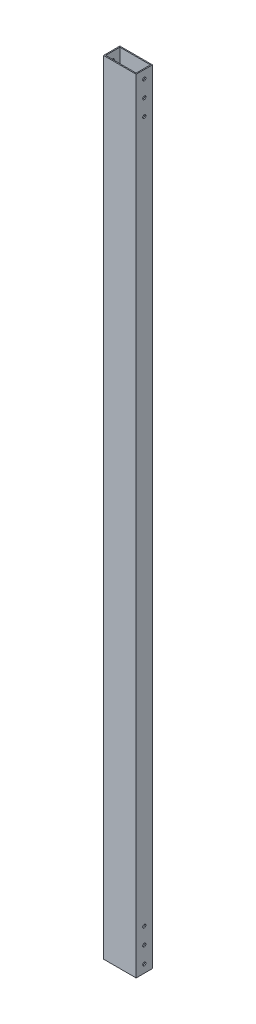
ISO-10303-21;
HEADER;
FILE_DESCRIPTION(('STEP AP214'),'2;1');
FILE_NAME('part.step','',(''),(''),'','','');
FILE_SCHEMA(('AUTOMOTIVE_DESIGN { 1 0 10303 214 1 1 1 1 }'));
ENDSEC;
DATA;
#1=APPLICATION_CONTEXT('core data for automotive mechanical design processes');
#2=APPLICATION_PROTOCOL_DEFINITION('international standard','automotive_design',2000,#1);
#3=PRODUCT_CONTEXT('',#1,'mechanical');
#4=PRODUCT('Part','Part','',(#3));
#5=PRODUCT_RELATED_PRODUCT_CATEGORY('part','',(#4));
#6=PRODUCT_DEFINITION_FORMATION('','',#4);
#7=PRODUCT_DEFINITION_CONTEXT('part definition',#1,'design');
#8=PRODUCT_DEFINITION('design','',#6,#7);
#9=PRODUCT_DEFINITION_SHAPE('','',#8);
#10=(LENGTH_UNIT() NAMED_UNIT(*) SI_UNIT(.MILLI.,.METRE.));
#11=(NAMED_UNIT(*) PLANE_ANGLE_UNIT() SI_UNIT($,.RADIAN.));
#12=(NAMED_UNIT(*) SI_UNIT($,.STERADIAN.) SOLID_ANGLE_UNIT());
#13=UNCERTAINTY_MEASURE_WITH_UNIT(LENGTH_MEASURE(1.E-05),#10,'distance_accuracy_value','');
#14=(GEOMETRIC_REPRESENTATION_CONTEXT(3) GLOBAL_UNCERTAINTY_ASSIGNED_CONTEXT((#13)) GLOBAL_UNIT_ASSIGNED_CONTEXT((#10,
#11,#12)) REPRESENTATION_CONTEXT('',''));
#15=CARTESIAN_POINT('',(0.,0.,0.));
#16=DIRECTION('',(0.,0.,1.));
#17=DIRECTION('',(1.,0.,0.));
#18=AXIS2_PLACEMENT_3D('',#15,#16,#17);
#19=CARTESIAN_POINT('',(0.,12.7,-12.7));
#20=DIRECTION('',(1.,0.,0.));
#21=DIRECTION('',(0.,0.,-1.));
#22=AXIS2_PLACEMENT_3D('',#19,#20,#21);
#23=CYLINDRICAL_SURFACE('',#22,2.4892);
#24=CARTESIAN_POINT('',(1.5875,12.7,-12.7));
#25=DIRECTION('',(-1.,0.,0.));
#26=DIRECTION('',(0.,0.,-1.));
#27=AXIS2_PLACEMENT_3D('',#24,#25,#26);
#28=CIRCLE('',#27,2.4892);
#29=CARTESIAN_POINT('',(1.5875,12.7,-15.1892));
#30=VERTEX_POINT('',#29);
#31=EDGE_CURVE('E255',#30,#30,#28,.T.);
#32=ORIENTED_EDGE('',*,*,#31,.F.);
#33=EDGE_LOOP('',(#32));
#34=FACE_BOUND('',#33,.T.);
#35=CARTESIAN_POINT('',(0.,12.7,-12.7));
#36=DIRECTION('',(-1.,0.,0.));
#37=DIRECTION('',(0.,0.,-1.));
#38=AXIS2_PLACEMENT_3D('',#35,#36,#37);
#39=CIRCLE('',#38,2.4892);
#40=CARTESIAN_POINT('',(0.,12.7,-15.1892));
#41=VERTEX_POINT('',#40);
#42=EDGE_CURVE('E305',#41,#41,#39,.T.);
#43=ORIENTED_EDGE('',*,*,#42,.T.);
#44=EDGE_LOOP('',(#43));
#45=FACE_BOUND('',#44,.T.);
#46=ADVANCED_FACE('F16',(#34,#45),#23,.F.);
#47=CARTESIAN_POINT('',(0.,38.1,-12.7000000000003));
#48=DIRECTION('',(1.,0.,0.));
#49=DIRECTION('',(0.,0.,-1.));
#50=AXIS2_PLACEMENT_3D('',#47,#48,#49);
#51=CYLINDRICAL_SURFACE('',#50,2.4892);
#52=CARTESIAN_POINT('',(1.5875,38.1,-12.7000000000003));
#53=DIRECTION('',(-1.,0.,0.));
#54=DIRECTION('',(0.,0.,-1.));
#55=AXIS2_PLACEMENT_3D('',#52,#53,#54);
#56=CIRCLE('',#55,2.4892);
#57=CARTESIAN_POINT('',(1.5875,38.1,-15.1892000000003));
#58=VERTEX_POINT('',#57);
#59=EDGE_CURVE('E251',#58,#58,#56,.T.);
#60=ORIENTED_EDGE('',*,*,#59,.F.);
#61=EDGE_LOOP('',(#60));
#62=FACE_BOUND('',#61,.T.);
#63=CARTESIAN_POINT('',(0.,38.1,-12.7000000000003));
#64=DIRECTION('',(-1.,0.,0.));
#65=DIRECTION('',(0.,0.,-1.));
#66=AXIS2_PLACEMENT_3D('',#63,#64,#65);
#67=CIRCLE('',#66,2.4892);
#68=CARTESIAN_POINT('',(0.,38.1,-15.1892000000003));
#69=VERTEX_POINT('',#68);
#70=EDGE_CURVE('E302',#69,#69,#67,.T.);
#71=ORIENTED_EDGE('',*,*,#70,.T.);
#72=EDGE_LOOP('',(#71));
#73=FACE_BOUND('',#72,.T.);
#74=ADVANCED_FACE('F383',(#62,#73),#51,.F.);
#75=CARTESIAN_POINT('',(0.,63.5,-12.7000000000005));
#76=DIRECTION('',(1.,0.,0.));
#77=DIRECTION('',(0.,0.,-1.));
#78=AXIS2_PLACEMENT_3D('',#75,#76,#77);
#79=CYLINDRICAL_SURFACE('',#78,2.4892);
#80=CARTESIAN_POINT('',(1.5875,63.5,-12.7000000000005));
#81=DIRECTION('',(-1.,0.,0.));
#82=DIRECTION('',(0.,0.,-1.));
#83=AXIS2_PLACEMENT_3D('',#80,#81,#82);
#84=CIRCLE('',#83,2.4892);
#85=CARTESIAN_POINT('',(1.5875,63.5,-15.1892000000006));
#86=VERTEX_POINT('',#85);
#87=EDGE_CURVE('E254',#86,#86,#84,.T.);
#88=ORIENTED_EDGE('',*,*,#87,.F.);
#89=EDGE_LOOP('',(#88));
#90=FACE_BOUND('',#89,.T.);
#91=CARTESIAN_POINT('',(0.,63.5,-12.7000000000005));
#92=DIRECTION('',(-1.,0.,0.));
#93=DIRECTION('',(0.,0.,-1.));
#94=AXIS2_PLACEMENT_3D('',#91,#92,#93);
#95=CIRCLE('',#94,2.4892);
#96=CARTESIAN_POINT('',(0.,63.5,-15.1892000000006));
#97=VERTEX_POINT('',#96);
#98=EDGE_CURVE('E299',#97,#97,#95,.T.);
#99=ORIENTED_EDGE('',*,*,#98,.T.);
#100=EDGE_LOOP('',(#99));
#101=FACE_BOUND('',#100,.T.);
#102=ADVANCED_FACE('F388',(#90,#101),#79,.F.);
#103=CARTESIAN_POINT('',(0.,12.7,-12.7));
#104=DIRECTION('',(1.,0.,0.));
#105=DIRECTION('',(0.,0.,-1.));
#106=AXIS2_PLACEMENT_3D('',#103,#104,#105);
#107=CYLINDRICAL_SURFACE('',#106,2.4892);
#108=CARTESIAN_POINT('',(49.2125,12.7,-12.7));
#109=DIRECTION('',(1.,0.,0.));
#110=DIRECTION('',(0.,0.,1.));
#111=AXIS2_PLACEMENT_3D('',#108,#109,#110);
#112=CIRCLE('',#111,2.4892);
#113=CARTESIAN_POINT('',(49.2125,12.7,-10.2108));
#114=VERTEX_POINT('',#113);
#115=EDGE_CURVE('E269',#114,#114,#112,.T.);
#116=ORIENTED_EDGE('',*,*,#115,.F.);
#117=EDGE_LOOP('',(#116));
#118=FACE_BOUND('',#117,.T.);
#119=CARTESIAN_POINT('',(50.8,12.7,-12.7));
#120=DIRECTION('',(-1.,0.,0.));
#121=DIRECTION('',(0.,0.,-1.));
#122=AXIS2_PLACEMENT_3D('',#119,#120,#121);
#123=CIRCLE('',#122,2.4892);
#124=CARTESIAN_POINT('',(50.8,12.7,-15.1892));
#125=VERTEX_POINT('',#124);
#126=EDGE_CURVE('E242',#125,#125,#123,.T.);
#127=ORIENTED_EDGE('',*,*,#126,.F.);
#128=EDGE_LOOP('',(#127));
#129=FACE_BOUND('',#128,.T.);
#130=ADVANCED_FACE('F582',(#118,#129),#107,.F.);
#131=CARTESIAN_POINT('',(0.,38.1,-12.7000000000003));
#132=DIRECTION('',(1.,0.,0.));
#133=DIRECTION('',(0.,0.,-1.));
#134=AXIS2_PLACEMENT_3D('',#131,#132,#133);
#135=CYLINDRICAL_SURFACE('',#134,2.4892);
#136=CARTESIAN_POINT('',(49.2125,38.1,-12.7000000000003));
#137=DIRECTION('',(1.,0.,0.));
#138=DIRECTION('',(0.,0.,1.));
#139=AXIS2_PLACEMENT_3D('',#136,#137,#138);
#140=CIRCLE('',#139,2.4892);
#141=CARTESIAN_POINT('',(49.2125,38.1,-10.2108000000002));
#142=VERTEX_POINT('',#141);
#143=EDGE_CURVE('E272',#142,#142,#140,.T.);
#144=ORIENTED_EDGE('',*,*,#143,.F.);
#145=EDGE_LOOP('',(#144));
#146=FACE_BOUND('',#145,.T.);
#147=CARTESIAN_POINT('',(50.8,38.1,-12.7000000000003));
#148=DIRECTION('',(-1.,0.,0.));
#149=DIRECTION('',(0.,0.,-1.));
#150=AXIS2_PLACEMENT_3D('',#147,#148,#149);
#151=CIRCLE('',#150,2.4892);
#152=CARTESIAN_POINT('',(50.8,38.1,-15.1892000000003));
#153=VERTEX_POINT('',#152);
#154=EDGE_CURVE('E273',#153,#153,#151,.T.);
#155=ORIENTED_EDGE('',*,*,#154,.F.);
#156=EDGE_LOOP('',(#155));
#157=FACE_BOUND('',#156,.T.);
#158=ADVANCED_FACE('F589',(#146,#157),#135,.F.);
#159=CARTESIAN_POINT('',(0.,63.5,-12.7000000000005));
#160=DIRECTION('',(1.,0.,0.));
#161=DIRECTION('',(0.,0.,-1.));
#162=AXIS2_PLACEMENT_3D('',#159,#160,#161);
#163=CYLINDRICAL_SURFACE('',#162,2.4892);
#164=CARTESIAN_POINT('',(49.2125,63.5,-12.7000000000005));
#165=DIRECTION('',(1.,0.,0.));
#166=DIRECTION('',(0.,0.,1.));
#167=AXIS2_PLACEMENT_3D('',#164,#165,#166);
#168=CIRCLE('',#167,2.4892);
#169=CARTESIAN_POINT('',(49.2125,63.5,-10.2108000000005));
#170=VERTEX_POINT('',#169);
#171=EDGE_CURVE('E276',#170,#170,#168,.T.);
#172=ORIENTED_EDGE('',*,*,#171,.F.);
#173=EDGE_LOOP('',(#172));
#174=FACE_BOUND('',#173,.T.);
#175=CARTESIAN_POINT('',(50.8,63.5,-12.7000000000005));
#176=DIRECTION('',(-1.,0.,0.));
#177=DIRECTION('',(0.,0.,-1.));
#178=AXIS2_PLACEMENT_3D('',#175,#176,#177);
#179=CIRCLE('',#178,2.4892);
#180=CARTESIAN_POINT('',(50.8,63.5,-15.1892000000006));
#181=VERTEX_POINT('',#180);
#182=EDGE_CURVE('E19',#181,#181,#179,.T.);
#183=ORIENTED_EDGE('',*,*,#182,.F.);
#184=EDGE_LOOP('',(#183));
#185=FACE_BOUND('',#184,.T.);
#186=ADVANCED_FACE('F593',(#174,#185),#163,.F.);
#187=CARTESIAN_POINT('',(0.,1206.5,-12.7));
#188=DIRECTION('',(1.,0.,0.));
#189=DIRECTION('',(0.,0.,-1.));
#190=AXIS2_PLACEMENT_3D('',#187,#188,#189);
#191=CYLINDRICAL_SURFACE('',#190,2.4892);
#192=CARTESIAN_POINT('',(1.5875,1206.5,-12.7));
#193=DIRECTION('',(1.,0.,0.));
#194=DIRECTION('',(0.,0.,-1.));
#195=AXIS2_PLACEMENT_3D('',#192,#193,#194);
#196=CIRCLE('',#195,2.4892);
#197=CARTESIAN_POINT('',(1.5875,1206.5,-15.1892));
#198=VERTEX_POINT('',#197);
#199=EDGE_CURVE('E334',#198,#198,#196,.T.);
#200=ORIENTED_EDGE('',*,*,#199,.T.);
#201=EDGE_LOOP('',(#200));
#202=FACE_BOUND('',#201,.T.);
#203=CARTESIAN_POINT('',(0.,1206.5,-12.7));
#204=DIRECTION('',(1.,0.,0.));
#205=DIRECTION('',(0.,0.,-1.));
#206=AXIS2_PLACEMENT_3D('',#203,#204,#205);
#207=CIRCLE('',#206,2.4892);
#208=CARTESIAN_POINT('',(0.,1206.5,-15.1892));
#209=VERTEX_POINT('',#208);
#210=EDGE_CURVE('E234',#209,#209,#207,.T.);
#211=ORIENTED_EDGE('',*,*,#210,.F.);
#212=EDGE_LOOP('',(#211));
#213=FACE_BOUND('',#212,.T.);
#214=ADVANCED_FACE('F623',(#202,#213),#191,.F.);
#215=CARTESIAN_POINT('',(0.,1181.1,-12.7000000000003));
#216=DIRECTION('',(1.,0.,0.));
#217=DIRECTION('',(0.,0.,-1.));
#218=AXIS2_PLACEMENT_3D('',#215,#216,#217);
#219=CYLINDRICAL_SURFACE('',#218,2.4892);
#220=CARTESIAN_POINT('',(1.5875,1181.1,-12.7000000000003));
#221=DIRECTION('',(1.,0.,0.));
#222=DIRECTION('',(0.,0.,-1.));
#223=AXIS2_PLACEMENT_3D('',#220,#221,#222);
#224=CIRCLE('',#223,2.4892);
#225=CARTESIAN_POINT('',(1.5875,1181.1,-15.1892000000003));
#226=VERTEX_POINT('',#225);
#227=EDGE_CURVE('E337',#226,#226,#224,.T.);
#228=ORIENTED_EDGE('',*,*,#227,.T.);
#229=EDGE_LOOP('',(#228));
#230=FACE_BOUND('',#229,.T.);
#231=CARTESIAN_POINT('',(0.,1181.1,-12.7000000000003));
#232=DIRECTION('',(1.,0.,0.));
#233=DIRECTION('',(0.,0.,-1.));
#234=AXIS2_PLACEMENT_3D('',#231,#232,#233);
#235=CIRCLE('',#234,2.4892);
#236=CARTESIAN_POINT('',(0.,1181.1,-15.1892000000003));
#237=VERTEX_POINT('',#236);
#238=EDGE_CURVE('E230',#237,#237,#235,.T.);
#239=ORIENTED_EDGE('',*,*,#238,.F.);
#240=EDGE_LOOP('',(#239));
#241=FACE_BOUND('',#240,.T.);
#242=ADVANCED_FACE('F625',(#230,#241),#219,.F.);
#243=CARTESIAN_POINT('',(0.,1155.7,-12.7000000000005));
#244=DIRECTION('',(1.,0.,0.));
#245=DIRECTION('',(0.,0.,-1.));
#246=AXIS2_PLACEMENT_3D('',#243,#244,#245);
#247=CYLINDRICAL_SURFACE('',#246,2.4892);
#248=CARTESIAN_POINT('',(1.5875,1155.7,-12.7000000000005));
#249=DIRECTION('',(1.,0.,0.));
#250=DIRECTION('',(0.,0.,-1.));
#251=AXIS2_PLACEMENT_3D('',#248,#249,#250);
#252=CIRCLE('',#251,2.4892);
#253=CARTESIAN_POINT('',(1.5875,1155.7,-15.1892000000006));
#254=VERTEX_POINT('',#253);
#255=EDGE_CURVE('E202',#254,#254,#252,.T.);
#256=ORIENTED_EDGE('',*,*,#255,.T.);
#257=EDGE_LOOP('',(#256));
#258=FACE_BOUND('',#257,.T.);
#259=CARTESIAN_POINT('',(0.,1155.7,-12.7000000000005));
#260=DIRECTION('',(1.,0.,0.));
#261=DIRECTION('',(0.,0.,-1.));
#262=AXIS2_PLACEMENT_3D('',#259,#260,#261);
#263=CIRCLE('',#262,2.4892);
#264=CARTESIAN_POINT('',(0.,1155.7,-15.1892000000006));
#265=VERTEX_POINT('',#264);
#266=EDGE_CURVE('E233',#265,#265,#263,.T.);
#267=ORIENTED_EDGE('',*,*,#266,.F.);
#268=EDGE_LOOP('',(#267));
#269=FACE_BOUND('',#268,.T.);
#270=ADVANCED_FACE('F631',(#258,#269),#247,.F.);
#271=CARTESIAN_POINT('',(0.,1206.5,-12.7));
#272=DIRECTION('',(1.,0.,0.));
#273=DIRECTION('',(0.,0.,-1.));
#274=AXIS2_PLACEMENT_3D('',#271,#272,#273);
#275=CYLINDRICAL_SURFACE('',#274,2.4892);
#276=CARTESIAN_POINT('',(49.2125,1206.5,-12.7));
#277=DIRECTION('',(-1.,0.,0.));
#278=DIRECTION('',(0.,0.,1.));
#279=AXIS2_PLACEMENT_3D('',#276,#277,#278);
#280=CIRCLE('',#279,2.4892);
#281=CARTESIAN_POINT('',(49.2125,1206.5,-10.2108));
#282=VERTEX_POINT('',#281);
#283=EDGE_CURVE('E279',#282,#282,#280,.T.);
#284=ORIENTED_EDGE('',*,*,#283,.T.);
#285=EDGE_LOOP('',(#284));
#286=FACE_BOUND('',#285,.T.);
#287=CARTESIAN_POINT('',(50.8,1206.5,-12.7));
#288=DIRECTION('',(1.,0.,0.));
#289=DIRECTION('',(0.,0.,-1.));
#290=AXIS2_PLACEMENT_3D('',#287,#288,#289);
#291=CIRCLE('',#290,2.4892);
#292=CARTESIAN_POINT('',(50.8,1206.5,-15.1892));
#293=VERTEX_POINT('',#292);
#294=EDGE_CURVE('E243',#293,#293,#291,.T.);
#295=ORIENTED_EDGE('',*,*,#294,.T.);
#296=EDGE_LOOP('',(#295));
#297=FACE_BOUND('',#296,.T.);
#298=ADVANCED_FACE('F621',(#286,#297),#275,.F.);
#299=CARTESIAN_POINT('',(0.,1181.1,-12.7000000000003));
#300=DIRECTION('',(1.,0.,0.));
#301=DIRECTION('',(0.,0.,-1.));
#302=AXIS2_PLACEMENT_3D('',#299,#300,#301);
#303=CYLINDRICAL_SURFACE('',#302,2.4892);
#304=CARTESIAN_POINT('',(49.2125,1181.1,-12.7000000000003));
#305=DIRECTION('',(-1.,0.,0.));
#306=DIRECTION('',(0.,0.,1.));
#307=AXIS2_PLACEMENT_3D('',#304,#305,#306);
#308=CIRCLE('',#307,2.4892);
#309=CARTESIAN_POINT('',(49.2125,1181.1,-10.2108000000002));
#310=VERTEX_POINT('',#309);
#311=EDGE_CURVE('E26',#310,#310,#308,.T.);
#312=ORIENTED_EDGE('',*,*,#311,.T.);
#313=EDGE_LOOP('',(#312));
#314=FACE_BOUND('',#313,.T.);
#315=CARTESIAN_POINT('',(50.8,1181.1,-12.7000000000003));
#316=DIRECTION('',(1.,0.,0.));
#317=DIRECTION('',(0.,0.,-1.));
#318=AXIS2_PLACEMENT_3D('',#315,#316,#317);
#319=CIRCLE('',#318,2.4892);
#320=CARTESIAN_POINT('',(50.8,1181.1,-15.1892000000003));
#321=VERTEX_POINT('',#320);
#322=EDGE_CURVE('E246',#321,#321,#319,.T.);
#323=ORIENTED_EDGE('',*,*,#322,.T.);
#324=EDGE_LOOP('',(#323));
#325=FACE_BOUND('',#324,.T.);
#326=ADVANCED_FACE('F378',(#314,#325),#303,.F.);
#327=CARTESIAN_POINT('',(0.,1155.7,-12.7000000000005));
#328=DIRECTION('',(1.,0.,0.));
#329=DIRECTION('',(0.,0.,-1.));
#330=AXIS2_PLACEMENT_3D('',#327,#328,#329);
#331=CYLINDRICAL_SURFACE('',#330,2.4892);
#332=CARTESIAN_POINT('',(49.2125,1155.7,-12.7000000000005));
#333=DIRECTION('',(-1.,0.,0.));
#334=DIRECTION('',(0.,0.,1.));
#335=AXIS2_PLACEMENT_3D('',#332,#333,#334);
#336=CIRCLE('',#335,2.4892);
#337=CARTESIAN_POINT('',(49.2125,1155.7,-10.2108000000005));
#338=VERTEX_POINT('',#337);
#339=EDGE_CURVE('E11',#338,#338,#336,.T.);
#340=ORIENTED_EDGE('',*,*,#339,.T.);
#341=EDGE_LOOP('',(#340));
#342=FACE_BOUND('',#341,.T.);
#343=CARTESIAN_POINT('',(50.8,1155.7,-12.7000000000005));
#344=DIRECTION('',(1.,0.,0.));
#345=DIRECTION('',(0.,0.,-1.));
#346=AXIS2_PLACEMENT_3D('',#343,#344,#345);
#347=CIRCLE('',#346,2.4892);
#348=CARTESIAN_POINT('',(50.8,1155.7,-15.1892000000006));
#349=VERTEX_POINT('',#348);
#350=EDGE_CURVE('E312',#349,#349,#347,.T.);
#351=ORIENTED_EDGE('',*,*,#350,.T.);
#352=EDGE_LOOP('',(#351));
#353=FACE_BOUND('',#352,.T.);
#354=ADVANCED_FACE('F369',(#342,#353),#331,.F.);
#355=CARTESIAN_POINT('',(1.5875,1219.2,-23.8125));
#356=DIRECTION('',(0.,0.,1.));
#357=DIRECTION('',(1.,0.,0.));
#358=AXIS2_PLACEMENT_3D('',#355,#356,#357);
#359=PLANE('',#358);
#360=DIRECTION('',(-1.,0.,0.));
#361=VECTOR('',#360,1.);
#362=CARTESIAN_POINT('',(1.5875,0.,-23.8125));
#363=LINE('',#362,#361);
#364=CARTESIAN_POINT('',(49.2125,0.,-23.8125));
#365=VERTEX_POINT('',#364);
#366=CARTESIAN_POINT('',(1.5875,0.,-23.8125));
#367=VERTEX_POINT('',#366);
#368=EDGE_CURVE('E318',#365,#367,#363,.T.);
#369=ORIENTED_EDGE('',*,*,#368,.F.);
#370=DIRECTION('',(0.,-1.,0.));
#371=VECTOR('',#370,1.);
#372=CARTESIAN_POINT('',(49.2125,1219.2,-23.8125));
#373=LINE('',#372,#371);
#374=CARTESIAN_POINT('',(49.2125,1219.2,-23.8125));
#375=VERTEX_POINT('',#374);
#376=EDGE_CURVE('E201',#375,#365,#373,.T.);
#377=ORIENTED_EDGE('',*,*,#376,.F.);
#378=DIRECTION('',(-1.,0.,0.));
#379=VECTOR('',#378,1.);
#380=CARTESIAN_POINT('',(1.5875,1219.2,-23.8125));
#381=LINE('',#380,#379);
#382=CARTESIAN_POINT('',(1.5875,1219.2,-23.8125));
#383=VERTEX_POINT('',#382);
#384=EDGE_CURVE('E217',#375,#383,#381,.T.);
#385=ORIENTED_EDGE('',*,*,#384,.T.);
#386=DIRECTION('',(0.,-1.,0.));
#387=VECTOR('',#386,1.);
#388=CARTESIAN_POINT('',(1.5875,1219.2,-23.8125));
#389=LINE('',#388,#387);
#390=EDGE_CURVE('E309',#383,#367,#389,.T.);
#391=ORIENTED_EDGE('',*,*,#390,.T.);
#392=EDGE_LOOP('',(#369,#377,#385,#391));
#393=FACE_BOUND('',#392,.T.);
#394=ADVANCED_FACE('F367',(#393),#359,.T.);
#395=CARTESIAN_POINT('',(49.2125,1219.2,-1.5875));
#396=DIRECTION('',(-1.,0.,0.));
#397=DIRECTION('',(0.,0.,1.));
#398=AXIS2_PLACEMENT_3D('',#395,#396,#397);
#399=PLANE('',#398);
#400=ORIENTED_EDGE('',*,*,#339,.F.);
#401=EDGE_LOOP('',(#400));
#402=FACE_BOUND('',#401,.T.);
#403=ORIENTED_EDGE('',*,*,#311,.F.);
#404=EDGE_LOOP('',(#403));
#405=FACE_BOUND('',#404,.T.);
#406=ORIENTED_EDGE('',*,*,#283,.F.);
#407=EDGE_LOOP('',(#406));
#408=FACE_BOUND('',#407,.T.);
#409=ORIENTED_EDGE('',*,*,#171,.T.);
#410=EDGE_LOOP('',(#409));
#411=FACE_BOUND('',#410,.T.);
#412=ORIENTED_EDGE('',*,*,#143,.T.);
#413=EDGE_LOOP('',(#412));
#414=FACE_BOUND('',#413,.T.);
#415=ORIENTED_EDGE('',*,*,#115,.T.);
#416=EDGE_LOOP('',(#415));
#417=FACE_BOUND('',#416,.T.);
#418=DIRECTION('',(0.,0.,-1.));
#419=VECTOR('',#418,1.);
#420=CARTESIAN_POINT('',(49.2125,0.,-1.5875));
#421=LINE('',#420,#419);
#422=CARTESIAN_POINT('',(49.2125,0.,-1.5875));
#423=VERTEX_POINT('',#422);
#424=EDGE_CURVE('E196',#423,#365,#421,.T.);
#425=ORIENTED_EDGE('',*,*,#424,.F.);
#426=DIRECTION('',(0.,-1.,0.));
#427=VECTOR('',#426,1.);
#428=CARTESIAN_POINT('',(49.2125,1219.2,-1.5875));
#429=LINE('',#428,#427);
#430=CARTESIAN_POINT('',(49.2125,1219.2,-1.5875));
#431=VERTEX_POINT('',#430);
#432=EDGE_CURVE('E189',#431,#423,#429,.T.);
#433=ORIENTED_EDGE('',*,*,#432,.F.);
#434=DIRECTION('',(0.,0.,-1.));
#435=VECTOR('',#434,1.);
#436=CARTESIAN_POINT('',(49.2125,1219.2,-1.5875));
#437=LINE('',#436,#435);
#438=EDGE_CURVE('E193',#431,#375,#437,.T.);
#439=ORIENTED_EDGE('',*,*,#438,.T.);
#440=ORIENTED_EDGE('',*,*,#376,.T.);
#441=EDGE_LOOP('',(#425,#433,#439,#440));
#442=FACE_BOUND('',#441,.T.);
#443=ADVANCED_FACE('F191',(#402,#405,#408,#411,#414,#417,#442),#399,.T.);
#444=CARTESIAN_POINT('',(1.5875,1219.2,-1.5875));
#445=DIRECTION('',(0.,0.,-1.));
#446=DIRECTION('',(0.,-1.,0.));
#447=AXIS2_PLACEMENT_3D('',#444,#445,#446);
#448=PLANE('',#447);
#449=DIRECTION('',(1.,0.,0.));
#450=VECTOR('',#449,1.);
#451=CARTESIAN_POINT('',(1.5875,0.,-1.5875));
#452=LINE('',#451,#450);
#453=CARTESIAN_POINT('',(1.5875,0.,-1.5875));
#454=VERTEX_POINT('',#453);
#455=EDGE_CURVE('E247',#454,#423,#452,.T.);
#456=ORIENTED_EDGE('',*,*,#455,.F.);
#457=DIRECTION('',(0.,-1.,0.));
#458=VECTOR('',#457,1.);
#459=CARTESIAN_POINT('',(1.5875,1219.2,-1.5875));
#460=LINE('',#459,#458);
#461=CARTESIAN_POINT('',(1.5875,1219.2,-1.5875));
#462=VERTEX_POINT('',#461);
#463=EDGE_CURVE('E207',#462,#454,#460,.T.);
#464=ORIENTED_EDGE('',*,*,#463,.F.);
#465=DIRECTION('',(1.,0.,0.));
#466=VECTOR('',#465,1.);
#467=CARTESIAN_POINT('',(1.5875,1219.2,-1.5875));
#468=LINE('',#467,#466);
#469=EDGE_CURVE('E205',#462,#431,#468,.T.);
#470=ORIENTED_EDGE('',*,*,#469,.T.);
#471=ORIENTED_EDGE('',*,*,#432,.T.);
#472=EDGE_LOOP('',(#456,#464,#470,#471));
#473=FACE_BOUND('',#472,.T.);
#474=ADVANCED_FACE('F206',(#473),#448,.T.);
#475=CARTESIAN_POINT('',(1.5875,1219.2,-1.5875));
#476=DIRECTION('',(1.,0.,0.));
#477=DIRECTION('',(0.,1.,0.));
#478=AXIS2_PLACEMENT_3D('',#475,#476,#477);
#479=PLANE('',#478);
#480=ORIENTED_EDGE('',*,*,#255,.F.);
#481=EDGE_LOOP('',(#480));
#482=FACE_BOUND('',#481,.T.);
#483=ORIENTED_EDGE('',*,*,#227,.F.);
#484=EDGE_LOOP('',(#483));
#485=FACE_BOUND('',#484,.T.);
#486=ORIENTED_EDGE('',*,*,#199,.F.);
#487=EDGE_LOOP('',(#486));
#488=FACE_BOUND('',#487,.T.);
#489=ORIENTED_EDGE('',*,*,#87,.T.);
#490=EDGE_LOOP('',(#489));
#491=FACE_BOUND('',#490,.T.);
#492=ORIENTED_EDGE('',*,*,#59,.T.);
#493=EDGE_LOOP('',(#492));
#494=FACE_BOUND('',#493,.T.);
#495=ORIENTED_EDGE('',*,*,#31,.T.);
#496=EDGE_LOOP('',(#495));
#497=FACE_BOUND('',#496,.T.);
#498=DIRECTION('',(0.,0.,1.));
#499=VECTOR('',#498,1.);
#500=CARTESIAN_POINT('',(1.5875,0.,-1.5875));
#501=LINE('',#500,#499);
#502=EDGE_CURVE('E250',#367,#454,#501,.T.);
#503=ORIENTED_EDGE('',*,*,#502,.F.);
#504=ORIENTED_EDGE('',*,*,#390,.F.);
#505=DIRECTION('',(0.,0.,1.));
#506=VECTOR('',#505,1.);
#507=CARTESIAN_POINT('',(1.5875,1219.2,-1.5875));
#508=LINE('',#507,#506);
#509=EDGE_CURVE('E224',#383,#462,#508,.T.);
#510=ORIENTED_EDGE('',*,*,#509,.T.);
#511=ORIENTED_EDGE('',*,*,#463,.T.);
#512=EDGE_LOOP('',(#503,#504,#510,#511));
#513=FACE_BOUND('',#512,.T.);
#514=ADVANCED_FACE('F365',(#482,#485,#488,#491,#494,#497,#513),#479,.T.);
#515=CARTESIAN_POINT('',(0.,1219.2,-25.4));
#516=DIRECTION('',(0.,0.,1.));
#517=DIRECTION('',(1.,0.,0.));
#518=AXIS2_PLACEMENT_3D('',#515,#516,#517);
#519=PLANE('',#518);
#520=DIRECTION('',(-1.,0.,0.));
#521=VECTOR('',#520,1.);
#522=CARTESIAN_POINT('',(0.,0.,-25.4));
#523=LINE('',#522,#521);
#524=CARTESIAN_POINT('',(50.8,0.,-25.4));
#525=VERTEX_POINT('',#524);
#526=CARTESIAN_POINT('',(0.,0.,-25.4));
#527=VERTEX_POINT('',#526);
#528=EDGE_CURVE('E238',#525,#527,#523,.T.);
#529=ORIENTED_EDGE('',*,*,#528,.T.);
#530=DIRECTION('',(0.,-1.,0.));
#531=VECTOR('',#530,1.);
#532=CARTESIAN_POINT('',(0.,1219.2,-25.4));
#533=LINE('',#532,#531);
#534=CARTESIAN_POINT('',(0.,1219.2,-25.4));
#535=VERTEX_POINT('',#534);
#536=EDGE_CURVE('E308',#535,#527,#533,.T.);
#537=ORIENTED_EDGE('',*,*,#536,.F.);
#538=DIRECTION('',(-1.,0.,0.));
#539=VECTOR('',#538,1.);
#540=CARTESIAN_POINT('',(0.,1219.2,-25.4));
#541=LINE('',#540,#539);
#542=CARTESIAN_POINT('',(50.8,1219.2,-25.4));
#543=VERTEX_POINT('',#542);
#544=EDGE_CURVE('E258',#543,#535,#541,.T.);
#545=ORIENTED_EDGE('',*,*,#544,.F.);
#546=DIRECTION('',(0.,-1.,0.));
#547=VECTOR('',#546,1.);
#548=CARTESIAN_POINT('',(50.8,1219.2,-25.4));
#549=LINE('',#548,#547);
#550=EDGE_CURVE('E239',#543,#525,#549,.T.);
#551=ORIENTED_EDGE('',*,*,#550,.T.);
#552=EDGE_LOOP('',(#529,#537,#545,#551));
#553=FACE_BOUND('',#552,.T.);
#554=ADVANCED_FACE('F607',(#553),#519,.F.);
#555=CARTESIAN_POINT('',(50.8,1219.2,0.));
#556=DIRECTION('',(-1.,0.,0.));
#557=DIRECTION('',(0.,0.,1.));
#558=AXIS2_PLACEMENT_3D('',#555,#556,#557);
#559=PLANE('',#558);
#560=ORIENTED_EDGE('',*,*,#350,.F.);
#561=EDGE_LOOP('',(#560));
#562=FACE_BOUND('',#561,.T.);
#563=ORIENTED_EDGE('',*,*,#322,.F.);
#564=EDGE_LOOP('',(#563));
#565=FACE_BOUND('',#564,.T.);
#566=ORIENTED_EDGE('',*,*,#294,.F.);
#567=EDGE_LOOP('',(#566));
#568=FACE_BOUND('',#567,.T.);
#569=ORIENTED_EDGE('',*,*,#182,.T.);
#570=EDGE_LOOP('',(#569));
#571=FACE_BOUND('',#570,.T.);
#572=ORIENTED_EDGE('',*,*,#154,.T.);
#573=EDGE_LOOP('',(#572));
#574=FACE_BOUND('',#573,.T.);
#575=ORIENTED_EDGE('',*,*,#126,.T.);
#576=EDGE_LOOP('',(#575));
#577=FACE_BOUND('',#576,.T.);
#578=DIRECTION('',(0.,0.,-1.));
#579=VECTOR('',#578,1.);
#580=CARTESIAN_POINT('',(50.8,0.,0.));
#581=LINE('',#580,#579);
#582=CARTESIAN_POINT('',(50.8,0.,0.));
#583=VERTEX_POINT('',#582);
#584=EDGE_CURVE('E259',#583,#525,#581,.T.);
#585=ORIENTED_EDGE('',*,*,#584,.T.);
#586=ORIENTED_EDGE('',*,*,#550,.F.);
#587=DIRECTION('',(0.,0.,-1.));
#588=VECTOR('',#587,1.);
#589=CARTESIAN_POINT('',(50.8,1219.2,0.));
#590=LINE('',#589,#588);
#591=CARTESIAN_POINT('',(50.8,1219.2,0.));
#592=VERTEX_POINT('',#591);
#593=EDGE_CURVE('E264',#592,#543,#590,.T.);
#594=ORIENTED_EDGE('',*,*,#593,.F.);
#595=DIRECTION('',(0.,-1.,0.));
#596=VECTOR('',#595,1.);
#597=CARTESIAN_POINT('',(50.8,1219.2,0.));
#598=LINE('',#597,#596);
#599=EDGE_CURVE('E228',#592,#583,#598,.T.);
#600=ORIENTED_EDGE('',*,*,#599,.T.);
#601=EDGE_LOOP('',(#585,#586,#594,#600));
#602=FACE_BOUND('',#601,.T.);
#603=ADVANCED_FACE('F603',(#562,#565,#568,#571,#574,#577,#602),#559,.F.);
#604=CARTESIAN_POINT('',(0.,1219.2,0.));
#605=DIRECTION('',(0.,0.,-1.));
#606=DIRECTION('',(0.,-1.,0.));
#607=AXIS2_PLACEMENT_3D('',#604,#605,#606);
#608=PLANE('',#607);
#609=DIRECTION('',(1.,0.,0.));
#610=VECTOR('',#609,1.);
#611=CARTESIAN_POINT('',(0.,0.,0.));
#612=LINE('',#611,#610);
#613=CARTESIAN_POINT('',(0.,0.,0.));
#614=VERTEX_POINT('',#613);
#615=EDGE_CURVE('E263',#614,#583,#612,.T.);
#616=ORIENTED_EDGE('',*,*,#615,.T.);
#617=ORIENTED_EDGE('',*,*,#599,.F.);
#618=DIRECTION('',(1.,0.,0.));
#619=VECTOR('',#618,1.);
#620=CARTESIAN_POINT('',(0.,1219.2,0.));
#621=LINE('',#620,#619);
#622=CARTESIAN_POINT('',(0.,1219.2,0.));
#623=VERTEX_POINT('',#622);
#624=EDGE_CURVE('E268',#623,#592,#621,.T.);
#625=ORIENTED_EDGE('',*,*,#624,.F.);
#626=DIRECTION('',(0.,-1.,0.));
#627=VECTOR('',#626,1.);
#628=CARTESIAN_POINT('',(0.,1219.2,0.));
#629=LINE('',#628,#627);
#630=EDGE_CURVE('E281',#623,#614,#629,.T.);
#631=ORIENTED_EDGE('',*,*,#630,.T.);
#632=EDGE_LOOP('',(#616,#617,#625,#631));
#633=FACE_BOUND('',#632,.T.);
#634=ADVANCED_FACE('F398',(#633),#608,.F.);
#635=CARTESIAN_POINT('',(0.,1219.2,0.));
#636=DIRECTION('',(1.,0.,0.));
#637=DIRECTION('',(0.,1.,0.));
#638=AXIS2_PLACEMENT_3D('',#635,#636,#637);
#639=PLANE('',#638);
#640=ORIENTED_EDGE('',*,*,#266,.T.);
#641=EDGE_LOOP('',(#640));
#642=FACE_BOUND('',#641,.T.);
#643=ORIENTED_EDGE('',*,*,#238,.T.);
#644=EDGE_LOOP('',(#643));
#645=FACE_BOUND('',#644,.T.);
#646=ORIENTED_EDGE('',*,*,#210,.T.);
#647=EDGE_LOOP('',(#646));
#648=FACE_BOUND('',#647,.T.);
#649=ORIENTED_EDGE('',*,*,#98,.F.);
#650=EDGE_LOOP('',(#649));
#651=FACE_BOUND('',#650,.T.);
#652=ORIENTED_EDGE('',*,*,#70,.F.);
#653=EDGE_LOOP('',(#652));
#654=FACE_BOUND('',#653,.T.);
#655=ORIENTED_EDGE('',*,*,#42,.F.);
#656=EDGE_LOOP('',(#655));
#657=FACE_BOUND('',#656,.T.);
#658=DIRECTION('',(0.,0.,1.));
#659=VECTOR('',#658,1.);
#660=CARTESIAN_POINT('',(0.,0.,0.));
#661=LINE('',#660,#659);
#662=EDGE_CURVE('E212',#527,#614,#661,.T.);
#663=ORIENTED_EDGE('',*,*,#662,.T.);
#664=ORIENTED_EDGE('',*,*,#630,.F.);
#665=DIRECTION('',(0.,0.,1.));
#666=VECTOR('',#665,1.);
#667=CARTESIAN_POINT('',(0.,1219.2,0.));
#668=LINE('',#667,#666);
#669=EDGE_CURVE('E284',#535,#623,#668,.T.);
#670=ORIENTED_EDGE('',*,*,#669,.F.);
#671=ORIENTED_EDGE('',*,*,#536,.T.);
#672=EDGE_LOOP('',(#663,#664,#670,#671));
#673=FACE_BOUND('',#672,.T.);
#674=ADVANCED_FACE('F395',(#642,#645,#648,#651,#654,#657,#673),#639,.F.);
#675=CARTESIAN_POINT('',(0.,0.,0.));
#676=DIRECTION('',(0.,-1.,0.));
#677=DIRECTION('',(0.,0.,-1.));
#678=AXIS2_PLACEMENT_3D('',#675,#676,#677);
#679=PLANE('',#678);
#680=ORIENTED_EDGE('',*,*,#368,.T.);
#681=ORIENTED_EDGE('',*,*,#502,.T.);
#682=ORIENTED_EDGE('',*,*,#455,.T.);
#683=ORIENTED_EDGE('',*,*,#424,.T.);
#684=EDGE_LOOP('',(#680,#681,#682,#683));
#685=FACE_BOUND('',#684,.T.);
#686=ORIENTED_EDGE('',*,*,#662,.F.);
#687=ORIENTED_EDGE('',*,*,#528,.F.);
#688=ORIENTED_EDGE('',*,*,#584,.F.);
#689=ORIENTED_EDGE('',*,*,#615,.F.);
#690=EDGE_LOOP('',(#686,#687,#688,#689));
#691=FACE_BOUND('',#690,.T.);
#692=ADVANCED_FACE('F361',(#685,#691),#679,.T.);
#693=CARTESIAN_POINT('',(0.,1219.2,0.));
#694=DIRECTION('',(0.,-1.,0.));
#695=DIRECTION('',(0.,0.,-1.));
#696=AXIS2_PLACEMENT_3D('',#693,#694,#695);
#697=PLANE('',#696);
#698=ORIENTED_EDGE('',*,*,#509,.F.);
#699=ORIENTED_EDGE('',*,*,#384,.F.);
#700=ORIENTED_EDGE('',*,*,#438,.F.);
#701=ORIENTED_EDGE('',*,*,#469,.F.);
#702=EDGE_LOOP('',(#698,#699,#700,#701));
#703=FACE_BOUND('',#702,.T.);
#704=ORIENTED_EDGE('',*,*,#669,.T.);
#705=ORIENTED_EDGE('',*,*,#624,.T.);
#706=ORIENTED_EDGE('',*,*,#593,.T.);
#707=ORIENTED_EDGE('',*,*,#544,.T.);
#708=EDGE_LOOP('',(#704,#705,#706,#707));
#709=FACE_BOUND('',#708,.T.);
#710=ADVANCED_FACE('F214',(#703,#709),#697,.F.);
#711=CLOSED_SHELL('',(#46,#74,#102,#130,#158,#186,#214,#242,#270,#298,#326,#354,#394,#443,#474,
#514,#554,#603,#634,#674,#692,#710));
#712=MANIFOLD_SOLID_BREP('B1',#711);
#713=ADVANCED_BREP_SHAPE_REPRESENTATION('',(#18,#712),#14);
#714=SHAPE_DEFINITION_REPRESENTATION(#9,#713);
ENDSEC;
END-ISO-10303-21;
